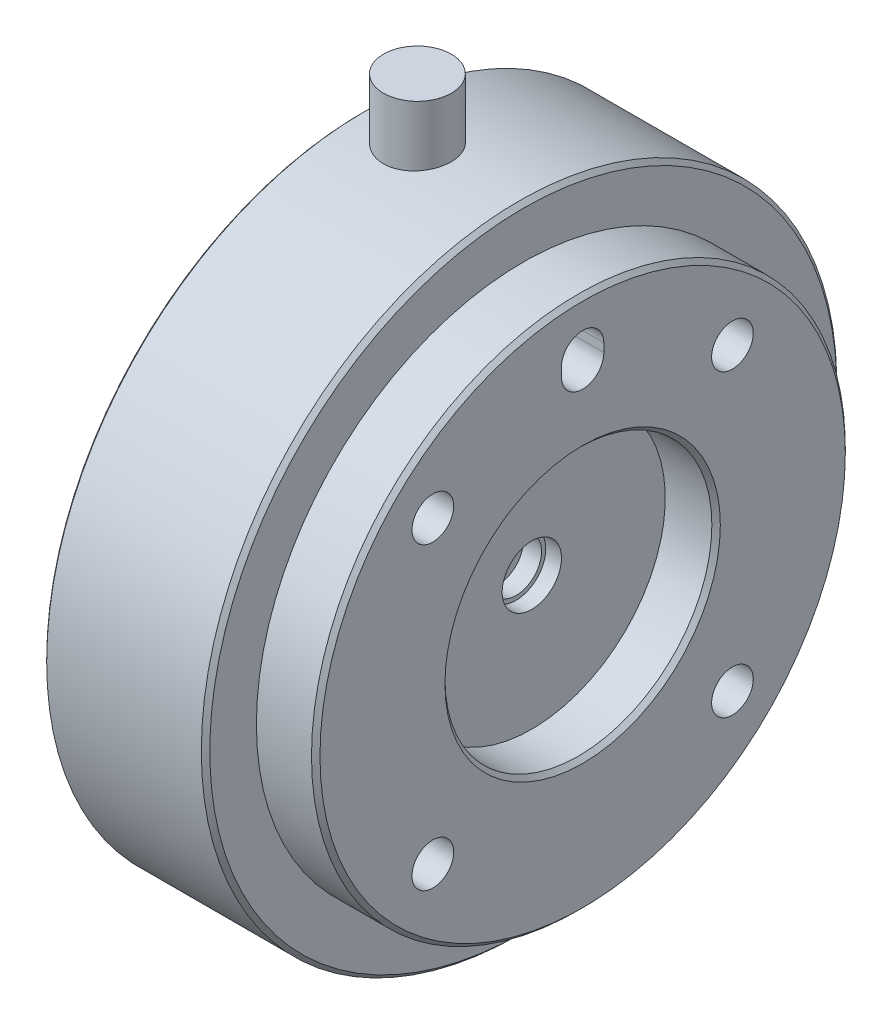
ISO-10303-21;
HEADER;
FILE_DESCRIPTION(('STEP AP214'),'2;1');
FILE_NAME('part.step','',(''),(''),'','','');
FILE_SCHEMA(('AUTOMOTIVE_DESIGN { 1 0 10303 214 1 1 1 1 }'));
ENDSEC;
DATA;
#1=APPLICATION_CONTEXT('core data for automotive mechanical design processes');
#2=APPLICATION_PROTOCOL_DEFINITION('international standard','automotive_design',2000,#1);
#3=PRODUCT_CONTEXT('',#1,'mechanical');
#4=PRODUCT('Part','Part','',(#3));
#5=PRODUCT_RELATED_PRODUCT_CATEGORY('part','',(#4));
#6=PRODUCT_DEFINITION_FORMATION('','',#4);
#7=PRODUCT_DEFINITION_CONTEXT('part definition',#1,'design');
#8=PRODUCT_DEFINITION('design','',#6,#7);
#9=PRODUCT_DEFINITION_SHAPE('','',#8);
#10=(LENGTH_UNIT() NAMED_UNIT(*) SI_UNIT(.MILLI.,.METRE.));
#11=(NAMED_UNIT(*) PLANE_ANGLE_UNIT() SI_UNIT($,.RADIAN.));
#12=(NAMED_UNIT(*) SI_UNIT($,.STERADIAN.) SOLID_ANGLE_UNIT());
#13=UNCERTAINTY_MEASURE_WITH_UNIT(LENGTH_MEASURE(1.E-05),#10,'distance_accuracy_value','');
#14=(GEOMETRIC_REPRESENTATION_CONTEXT(3) GLOBAL_UNCERTAINTY_ASSIGNED_CONTEXT((#13)) GLOBAL_UNIT_ASSIGNED_CONTEXT((#10,
#11,#12)) REPRESENTATION_CONTEXT('',''));
#15=CARTESIAN_POINT('',(0.,0.,0.));
#16=DIRECTION('',(0.,0.,1.));
#17=DIRECTION('',(1.,0.,0.));
#18=AXIS2_PLACEMENT_3D('',#15,#16,#17);
#19=CARTESIAN_POINT('',(24.5,0.,0.));
#20=DIRECTION('',(1.,0.,0.));
#21=DIRECTION('',(0.,0.,-1.));
#22=AXIS2_PLACEMENT_3D('',#19,#20,#21);
#23=PLANE('',#22);
#24=CARTESIAN_POINT('',(24.5,0.,0.));
#25=DIRECTION('',(1.,0.,0.));
#26=DIRECTION('',(0.,0.,-1.));
#27=AXIS2_PLACEMENT_3D('',#24,#25,#26);
#28=CIRCLE('',#27,3.);
#29=CARTESIAN_POINT('',(24.5,0.,-3.));
#30=VERTEX_POINT('',#29);
#31=EDGE_CURVE('P0_E19',#30,#30,#28,.T.);
#32=ORIENTED_EDGE('',*,*,#31,.T.);
#33=EDGE_LOOP('',(#32));
#34=FACE_BOUND('',#33,.T.);
#35=ADVANCED_FACE('P0_F16',(#34),#23,.T.);
#36=CARTESIAN_POINT('',(0.,0.,0.));
#37=DIRECTION('',(1.,0.,0.));
#38=DIRECTION('',(0.,0.,-1.));
#39=AXIS2_PLACEMENT_3D('',#36,#37,#38);
#40=CYLINDRICAL_SURFACE('',#39,3.);
#41=ORIENTED_EDGE('',*,*,#31,.F.);
#42=EDGE_LOOP('',(#41));
#43=FACE_BOUND('',#42,.T.);
#44=CARTESIAN_POINT('',(26.65,0.,0.));
#45=DIRECTION('',(1.,0.,0.));
#46=DIRECTION('',(0.,0.,-1.));
#47=AXIS2_PLACEMENT_3D('',#44,#45,#46);
#48=CIRCLE('',#47,3.);
#49=CARTESIAN_POINT('',(26.65,0.,-3.));
#50=VERTEX_POINT('',#49);
#51=EDGE_CURVE('P0_E93',#50,#50,#48,.F.);
#52=ORIENTED_EDGE('',*,*,#51,.F.);
#53=EDGE_LOOP('',(#52));
#54=FACE_BOUND('',#53,.T.);
#55=ADVANCED_FACE('P0_F101',(#43,#54),#40,.F.);
#56=CARTESIAN_POINT('',(26.65,0.,0.));
#57=DIRECTION('',(1.,0.,0.));
#58=DIRECTION('',(0.,0.,-1.));
#59=AXIS2_PLACEMENT_3D('',#56,#57,#58);
#60=PLANE('',#59);
#61=ORIENTED_EDGE('',*,*,#51,.T.);
#62=EDGE_LOOP('',(#61));
#63=FACE_BOUND('',#62,.T.);
#64=CARTESIAN_POINT('',(26.65,0.,0.));
#65=DIRECTION('',(1.,0.,0.));
#66=DIRECTION('',(0.,0.,-1.));
#67=AXIS2_PLACEMENT_3D('',#64,#65,#66);
#68=CIRCLE('',#67,3.5);
#69=CARTESIAN_POINT('',(26.65,0.,-3.5));
#70=VERTEX_POINT('',#69);
#71=EDGE_CURVE('P0_E91',#70,#70,#68,.T.);
#72=ORIENTED_EDGE('',*,*,#71,.T.);
#73=EDGE_LOOP('',(#72));
#74=FACE_BOUND('',#73,.T.);
#75=ADVANCED_FACE('P0_F104',(#63,#74),#60,.T.);
#76=CARTESIAN_POINT('',(26.65,0.,0.));
#77=DIRECTION('',(1.,0.,0.));
#78=DIRECTION('',(0.,0.,-1.));
#79=AXIS2_PLACEMENT_3D('',#76,#77,#78);
#80=CYLINDRICAL_SURFACE('',#79,3.5);
#81=ORIENTED_EDGE('',*,*,#71,.F.);
#82=EDGE_LOOP('',(#81));
#83=FACE_BOUND('',#82,.T.);
#84=CARTESIAN_POINT('',(28.5,0.,0.));
#85=DIRECTION('',(1.,0.,0.));
#86=DIRECTION('',(0.,0.,-1.));
#87=AXIS2_PLACEMENT_3D('',#84,#85,#86);
#88=CIRCLE('',#87,3.5);
#89=CARTESIAN_POINT('',(28.5,0.,-3.5));
#90=VERTEX_POINT('',#89);
#91=EDGE_CURVE('P0_E88',#90,#90,#88,.T.);
#92=ORIENTED_EDGE('',*,*,#91,.T.);
#93=EDGE_LOOP('',(#92));
#94=FACE_BOUND('',#93,.T.);
#95=ADVANCED_FACE('P0_F110',(#83,#94),#80,.F.);
#96=CARTESIAN_POINT('',(28.5,15.75,0.));
#97=DIRECTION('',(-1.,0.,0.));
#98=DIRECTION('',(0.,0.,1.));
#99=AXIS2_PLACEMENT_3D('',#96,#97,#98);
#100=PLANE('',#99);
#101=CARTESIAN_POINT('',(28.5,0.,0.));
#102=DIRECTION('',(-1.,0.,0.));
#103=DIRECTION('',(0.,0.,1.));
#104=AXIS2_PLACEMENT_3D('',#101,#102,#103);
#105=CIRCLE('',#104,15.75);
#106=CARTESIAN_POINT('',(28.5,0.,15.75));
#107=VERTEX_POINT('',#106);
#108=EDGE_CURVE('P0_E80',#107,#107,#105,.F.);
#109=ORIENTED_EDGE('',*,*,#108,.T.);
#110=EDGE_LOOP('',(#109));
#111=FACE_BOUND('',#110,.T.);
#112=ORIENTED_EDGE('',*,*,#91,.F.);
#113=EDGE_LOOP('',(#112));
#114=FACE_BOUND('',#113,.T.);
#115=ADVANCED_FACE('P0_F220',(#111,#114),#100,.F.);
#116=CARTESIAN_POINT('',(29.5,25.5,-2.49999999999999));
#117=DIRECTION('',(0.,0.,-1.));
#118=DIRECTION('',(-1.,0.,0.));
#119=AXIS2_PLACEMENT_3D('',#116,#117,#118);
#120=PLANE('',#119);
#121=DIRECTION('',(1.,0.,0.));
#122=VECTOR('',#121,1.);
#123=CARTESIAN_POINT('',(29.5,25.5,-2.49999999999999));
#124=LINE('',#123,#122);
#125=CARTESIAN_POINT('',(34.5,25.5,-2.49999999999999));
#126=VERTEX_POINT('',#125);
#127=CARTESIAN_POINT('',(29.5,25.5,-2.49999999999999));
#128=VERTEX_POINT('',#127);
#129=EDGE_CURVE('P0_E66',#126,#128,#124,.F.);
#130=ORIENTED_EDGE('',*,*,#129,.T.);
#131=DIRECTION('',(0.,1.,0.));
#132=VECTOR('',#131,1.);
#133=CARTESIAN_POINT('',(29.5,25.5,-2.49999999999999));
#134=LINE('',#133,#132);
#135=CARTESIAN_POINT('',(29.5,24.5,-2.49999999999999));
#136=VERTEX_POINT('',#135);
#137=EDGE_CURVE('P0_E60',#136,#128,#134,.T.);
#138=ORIENTED_EDGE('',*,*,#137,.F.);
#139=DIRECTION('',(1.,0.,0.));
#140=VECTOR('',#139,1.);
#141=CARTESIAN_POINT('',(29.5,24.5,-2.49999999999999));
#142=LINE('',#141,#140);
#143=CARTESIAN_POINT('',(34.5,24.5,-2.49999999999999));
#144=VERTEX_POINT('',#143);
#145=EDGE_CURVE('P0_E63',#136,#144,#142,.T.);
#146=ORIENTED_EDGE('',*,*,#145,.T.);
#147=DIRECTION('',(0.,1.,0.));
#148=VECTOR('',#147,1.);
#149=CARTESIAN_POINT('',(34.5,25.5,-2.49999999999999));
#150=LINE('',#149,#148);
#151=EDGE_CURVE('P0_E68',#126,#144,#150,.F.);
#152=ORIENTED_EDGE('',*,*,#151,.F.);
#153=EDGE_LOOP('',(#130,#138,#146,#152));
#154=FACE_BOUND('',#153,.T.);
#155=ADVANCED_FACE('P0_F62',(#154),#120,.F.);
#156=CARTESIAN_POINT('',(29.5,25.5,0.));
#157=DIRECTION('',(1.,0.,0.));
#158=DIRECTION('',(0.,0.,-1.));
#159=AXIS2_PLACEMENT_3D('',#156,#157,#158);
#160=PLANE('',#159);
#161=CARTESIAN_POINT('',(29.5,24.5,0.));
#162=DIRECTION('',(1.,0.,0.));
#163=DIRECTION('',(0.,0.,-1.));
#164=AXIS2_PLACEMENT_3D('',#161,#162,#163);
#165=CIRCLE('',#164,2.5);
#166=CARTESIAN_POINT('',(29.5,24.5,2.50000000000001));
#167=VERTEX_POINT('',#166);
#168=EDGE_CURVE('P0_E73',#167,#136,#165,.T.);
#169=ORIENTED_EDGE('',*,*,#168,.T.);
#170=ORIENTED_EDGE('',*,*,#137,.T.);
#171=CARTESIAN_POINT('',(29.5,25.5,0.));
#172=DIRECTION('',(1.,0.,0.));
#173=DIRECTION('',(0.,0.,-1.));
#174=AXIS2_PLACEMENT_3D('',#171,#172,#173);
#175=CIRCLE('',#174,2.5);
#176=CARTESIAN_POINT('',(29.5,25.5,2.50000000000001));
#177=VERTEX_POINT('',#176);
#178=EDGE_CURVE('P0_E84',#128,#177,#175,.T.);
#179=ORIENTED_EDGE('',*,*,#178,.T.);
#180=DIRECTION('',(0.,1.,0.));
#181=VECTOR('',#180,1.);
#182=CARTESIAN_POINT('',(29.5,24.5,2.50000000000001));
#183=LINE('',#182,#181);
#184=EDGE_CURVE('P0_E54',#177,#167,#183,.F.);
#185=ORIENTED_EDGE('',*,*,#184,.T.);
#186=EDGE_LOOP('',(#169,#170,#179,#185));
#187=FACE_BOUND('',#186,.T.);
#188=ADVANCED_FACE('P0_F77',(#187),#160,.T.);
#189=CARTESIAN_POINT('',(29.5,24.5,2.50000000000001));
#190=DIRECTION('',(0.,0.,1.));
#191=DIRECTION('',(1.,0.,0.));
#192=AXIS2_PLACEMENT_3D('',#189,#190,#191);
#193=PLANE('',#192);
#194=DIRECTION('',(1.,0.,0.));
#195=VECTOR('',#194,1.);
#196=CARTESIAN_POINT('',(29.5,24.5,2.50000000000001));
#197=LINE('',#196,#195);
#198=CARTESIAN_POINT('',(34.5,24.5,2.50000000000001));
#199=VERTEX_POINT('',#198);
#200=EDGE_CURVE('P0_E78',#199,#167,#197,.F.);
#201=ORIENTED_EDGE('',*,*,#200,.T.);
#202=ORIENTED_EDGE('',*,*,#184,.F.);
#203=DIRECTION('',(1.,0.,0.));
#204=VECTOR('',#203,1.);
#205=CARTESIAN_POINT('',(29.5,25.5,2.50000000000001));
#206=LINE('',#205,#204);
#207=CARTESIAN_POINT('',(34.5,25.5,2.50000000000001));
#208=VERTEX_POINT('',#207);
#209=EDGE_CURVE('P0_E430',#177,#208,#206,.T.);
#210=ORIENTED_EDGE('',*,*,#209,.T.);
#211=DIRECTION('',(0.,1.,0.));
#212=VECTOR('',#211,1.);
#213=CARTESIAN_POINT('',(34.5,24.5,2.50000000000001));
#214=LINE('',#213,#212);
#215=EDGE_CURVE('P0_E34',#199,#208,#214,.T.);
#216=ORIENTED_EDGE('',*,*,#215,.F.);
#217=EDGE_LOOP('',(#201,#202,#210,#216));
#218=FACE_BOUND('',#217,.T.);
#219=ADVANCED_FACE('P0_F211',(#218),#193,.F.);
#220=CARTESIAN_POINT('',(0.,0.,0.));
#221=DIRECTION('',(-1.,0.,0.));
#222=DIRECTION('',(0.,0.,1.));
#223=AXIS2_PLACEMENT_3D('',#220,#221,#222);
#224=CYLINDRICAL_SURFACE('',#223,15.75);
#225=ORIENTED_EDGE('',*,*,#108,.F.);
#226=EDGE_LOOP('',(#225));
#227=FACE_BOUND('',#226,.T.);
#228=CARTESIAN_POINT('',(34.,0.,0.));
#229=DIRECTION('',(1.,0.,0.));
#230=DIRECTION('',(0.,0.,-1.));
#231=AXIS2_PLACEMENT_3D('',#228,#229,#230);
#232=CIRCLE('',#231,15.75);
#233=CARTESIAN_POINT('',(34.,0.,-15.75));
#234=VERTEX_POINT('',#233);
#235=EDGE_CURVE('P0_E432',#234,#234,#232,.T.);
#236=ORIENTED_EDGE('',*,*,#235,.T.);
#237=EDGE_LOOP('',(#236));
#238=FACE_BOUND('',#237,.T.);
#239=ADVANCED_FACE('P0_F207',(#227,#238),#224,.F.);
#240=CARTESIAN_POINT('',(29.,-17.6776695296635,-17.6776695296638));
#241=DIRECTION('',(1.,0.,0.));
#242=DIRECTION('',(0.,0.,-1.));
#243=AXIS2_PLACEMENT_3D('',#240,#241,#242);
#244=PLANE('',#243);
#245=CARTESIAN_POINT('',(28.9999999999964,-17.6776695296635,-17.6776695296638));
#246=DIRECTION('',(1.,0.,0.));
#247=DIRECTION('',(0.,0.,-1.));
#248=AXIS2_PLACEMENT_3D('',#245,#246,#247);
#249=CIRCLE('',#248,2.46);
#250=CARTESIAN_POINT('',(28.9999999999964,-17.6776695296635,-20.1376695296638));
#251=VERTEX_POINT('',#250);
#252=EDGE_CURVE('P0_E436',#251,#251,#249,.T.);
#253=ORIENTED_EDGE('',*,*,#252,.T.);
#254=EDGE_LOOP('',(#253));
#255=FACE_BOUND('',#254,.T.);
#256=ADVANCED_FACE('P0_F203',(#255),#244,.T.);
#257=CARTESIAN_POINT('',(29.,17.6776695296637,-17.6776695296637));
#258=DIRECTION('',(1.,0.,0.));
#259=DIRECTION('',(0.,0.,-1.));
#260=AXIS2_PLACEMENT_3D('',#257,#258,#259);
#261=PLANE('',#260);
#262=CARTESIAN_POINT('',(28.9999999999964,17.6776695296637,-17.6776695296637));
#263=DIRECTION('',(1.,0.,0.));
#264=DIRECTION('',(0.,0.,-1.));
#265=AXIS2_PLACEMENT_3D('',#262,#263,#264);
#266=CIRCLE('',#265,2.46);
#267=CARTESIAN_POINT('',(28.9999999999964,17.6776695296637,-20.1376695296637));
#268=VERTEX_POINT('',#267);
#269=EDGE_CURVE('P0_E455',#268,#268,#266,.T.);
#270=ORIENTED_EDGE('',*,*,#269,.T.);
#271=EDGE_LOOP('',(#270));
#272=FACE_BOUND('',#271,.T.);
#273=ADVANCED_FACE('P0_F199',(#272),#261,.T.);
#274=CARTESIAN_POINT('',(29.,17.6776695296637,17.6776695296637));
#275=DIRECTION('',(1.,0.,0.));
#276=DIRECTION('',(0.,0.,-1.));
#277=AXIS2_PLACEMENT_3D('',#274,#275,#276);
#278=PLANE('',#277);
#279=CARTESIAN_POINT('',(28.9999999999964,17.6776695296637,17.6776695296637));
#280=DIRECTION('',(1.,0.,0.));
#281=DIRECTION('',(0.,0.,-1.));
#282=AXIS2_PLACEMENT_3D('',#279,#280,#281);
#283=CIRCLE('',#282,2.46);
#284=CARTESIAN_POINT('',(28.9999999999964,17.6776695296637,15.2176695296637));
#285=VERTEX_POINT('',#284);
#286=EDGE_CURVE('P0_E452',#285,#285,#283,.T.);
#287=ORIENTED_EDGE('',*,*,#286,.T.);
#288=EDGE_LOOP('',(#287));
#289=FACE_BOUND('',#288,.T.);
#290=ADVANCED_FACE('P0_F195',(#289),#278,.T.);
#291=CARTESIAN_POINT('',(29.,-17.6776695296638,17.6776695296636));
#292=DIRECTION('',(1.,0.,0.));
#293=DIRECTION('',(0.,0.,-1.));
#294=AXIS2_PLACEMENT_3D('',#291,#292,#293);
#295=PLANE('',#294);
#296=CARTESIAN_POINT('',(28.9999999999964,-17.6776695296638,17.6776695296636));
#297=DIRECTION('',(1.,0.,0.));
#298=DIRECTION('',(0.,0.,-1.));
#299=AXIS2_PLACEMENT_3D('',#296,#297,#298);
#300=CIRCLE('',#299,2.46);
#301=CARTESIAN_POINT('',(28.9999999999964,-17.6776695296638,15.2176695296636));
#302=VERTEX_POINT('',#301);
#303=EDGE_CURVE('P0_E446',#302,#302,#300,.T.);
#304=ORIENTED_EDGE('',*,*,#303,.T.);
#305=EDGE_LOOP('',(#304));
#306=FACE_BOUND('',#305,.T.);
#307=ADVANCED_FACE('P0_F192',(#306),#295,.T.);
#308=CARTESIAN_POINT('',(29.5,24.5,0.));
#309=DIRECTION('',(1.,0.,0.));
#310=DIRECTION('',(0.,0.,-1.));
#311=AXIS2_PLACEMENT_3D('',#308,#309,#310);
#312=CYLINDRICAL_SURFACE('',#311,2.5);
#313=ORIENTED_EDGE('',*,*,#145,.F.);
#314=ORIENTED_EDGE('',*,*,#168,.F.);
#315=ORIENTED_EDGE('',*,*,#200,.F.);
#316=CARTESIAN_POINT('',(34.5,24.5,0.));
#317=DIRECTION('',(1.,0.,0.));
#318=DIRECTION('',(0.,0.,-1.));
#319=AXIS2_PLACEMENT_3D('',#316,#317,#318);
#320=CIRCLE('',#319,2.5);
#321=EDGE_CURVE('P0_E75',#199,#144,#320,.T.);
#322=ORIENTED_EDGE('',*,*,#321,.T.);
#323=EDGE_LOOP('',(#313,#314,#315,#322));
#324=FACE_BOUND('',#323,.T.);
#325=ADVANCED_FACE('P0_F71',(#324),#312,.F.);
#326=CARTESIAN_POINT('',(29.5,25.5,0.));
#327=DIRECTION('',(1.,0.,0.));
#328=DIRECTION('',(0.,0.,-1.));
#329=AXIS2_PLACEMENT_3D('',#326,#327,#328);
#330=CYLINDRICAL_SURFACE('',#329,2.5);
#331=ORIENTED_EDGE('',*,*,#209,.F.);
#332=ORIENTED_EDGE('',*,*,#178,.F.);
#333=ORIENTED_EDGE('',*,*,#129,.F.);
#334=CARTESIAN_POINT('',(34.5,25.5,0.));
#335=DIRECTION('',(1.,0.,0.));
#336=DIRECTION('',(0.,0.,-1.));
#337=AXIS2_PLACEMENT_3D('',#334,#335,#336);
#338=CIRCLE('',#337,2.5);
#339=EDGE_CURVE('P0_E439',#126,#208,#338,.T.);
#340=ORIENTED_EDGE('',*,*,#339,.T.);
#341=EDGE_LOOP('',(#331,#332,#333,#340));
#342=FACE_BOUND('',#341,.T.);
#343=ADVANCED_FACE('P0_F185',(#342),#330,.F.);
#344=CARTESIAN_POINT('',(34.5,0.,0.));
#345=DIRECTION('',(1.,0.,0.));
#346=DIRECTION('',(0.,0.,-1.));
#347=AXIS2_PLACEMENT_3D('',#344,#345,#346);
#348=CONICAL_SURFACE('',#347,16.25,0.785398163397438);
#349=CARTESIAN_POINT('',(34.5,0.,0.));
#350=DIRECTION('',(1.,0.,0.));
#351=DIRECTION('',(0.,0.,-1.));
#352=AXIS2_PLACEMENT_3D('',#349,#350,#351);
#353=CIRCLE('',#352,16.25);
#354=CARTESIAN_POINT('',(34.5,0.,-16.25));
#355=VERTEX_POINT('',#354);
#356=EDGE_CURVE('P0_E441',#355,#355,#353,.T.);
#357=ORIENTED_EDGE('',*,*,#356,.T.);
#358=EDGE_LOOP('',(#357));
#359=FACE_BOUND('',#358,.T.);
#360=ORIENTED_EDGE('',*,*,#235,.F.);
#361=EDGE_LOOP('',(#360));
#362=FACE_BOUND('',#361,.T.);
#363=ADVANCED_FACE('P0_F181',(#359,#362),#348,.F.);
#364=CARTESIAN_POINT('',(-500000.,-17.6776695296635,-17.6776695296638));
#365=DIRECTION('',(1.,0.,0.));
#366=DIRECTION('',(0.,0.,-1.));
#367=AXIS2_PLACEMENT_3D('',#364,#365,#366);
#368=CYLINDRICAL_SURFACE('',#367,2.46);
#369=ORIENTED_EDGE('',*,*,#252,.F.);
#370=EDGE_LOOP('',(#369));
#371=FACE_BOUND('',#370,.T.);
#372=CARTESIAN_POINT('',(34.49999999998,-17.6776695296635,-17.6776695296638));
#373=DIRECTION('',(1.,0.,0.));
#374=DIRECTION('',(0.,0.,-1.));
#375=AXIS2_PLACEMENT_3D('',#372,#373,#374);
#376=CIRCLE('',#375,2.46);
#377=CARTESIAN_POINT('',(34.49999999998,-17.6776695296635,-20.1376695296638));
#378=VERTEX_POINT('',#377);
#379=EDGE_CURVE('P0_E444',#378,#378,#376,.T.);
#380=ORIENTED_EDGE('',*,*,#379,.T.);
#381=EDGE_LOOP('',(#380));
#382=FACE_BOUND('',#381,.T.);
#383=ADVANCED_FACE('P0_F177',(#371,#382),#368,.F.);
#384=CARTESIAN_POINT('',(-500000.,17.6776695296637,-17.6776695296637));
#385=DIRECTION('',(1.,0.,0.));
#386=DIRECTION('',(0.,0.,-1.));
#387=AXIS2_PLACEMENT_3D('',#384,#385,#386);
#388=CYLINDRICAL_SURFACE('',#387,2.46);
#389=ORIENTED_EDGE('',*,*,#269,.F.);
#390=EDGE_LOOP('',(#389));
#391=FACE_BOUND('',#390,.T.);
#392=CARTESIAN_POINT('',(34.49999999998,17.6776695296637,-17.6776695296637));
#393=DIRECTION('',(1.,0.,0.));
#394=DIRECTION('',(0.,0.,-1.));
#395=AXIS2_PLACEMENT_3D('',#392,#393,#394);
#396=CIRCLE('',#395,2.46);
#397=CARTESIAN_POINT('',(34.49999999998,17.6776695296637,-20.1376695296637));
#398=VERTEX_POINT('',#397);
#399=EDGE_CURVE('P0_E463',#398,#398,#396,.T.);
#400=ORIENTED_EDGE('',*,*,#399,.T.);
#401=EDGE_LOOP('',(#400));
#402=FACE_BOUND('',#401,.T.);
#403=ADVANCED_FACE('P0_F173',(#391,#402),#388,.F.);
#404=CARTESIAN_POINT('',(-500000.,17.6776695296637,17.6776695296637));
#405=DIRECTION('',(1.,0.,0.));
#406=DIRECTION('',(0.,0.,-1.));
#407=AXIS2_PLACEMENT_3D('',#404,#405,#406);
#408=CYLINDRICAL_SURFACE('',#407,2.46);
#409=ORIENTED_EDGE('',*,*,#286,.F.);
#410=EDGE_LOOP('',(#409));
#411=FACE_BOUND('',#410,.T.);
#412=CARTESIAN_POINT('',(34.49999999998,17.6776695296637,17.6776695296637));
#413=DIRECTION('',(1.,0.,0.));
#414=DIRECTION('',(0.,0.,-1.));
#415=AXIS2_PLACEMENT_3D('',#412,#413,#414);
#416=CIRCLE('',#415,2.46);
#417=CARTESIAN_POINT('',(34.49999999998,17.6776695296637,15.2176695296637));
#418=VERTEX_POINT('',#417);
#419=EDGE_CURVE('P0_E465',#418,#418,#416,.T.);
#420=ORIENTED_EDGE('',*,*,#419,.T.);
#421=EDGE_LOOP('',(#420));
#422=FACE_BOUND('',#421,.T.);
#423=ADVANCED_FACE('P0_F169',(#411,#422),#408,.F.);
#424=CARTESIAN_POINT('',(-500000.,-17.6776695296638,17.6776695296636));
#425=DIRECTION('',(1.,0.,0.));
#426=DIRECTION('',(0.,0.,-1.));
#427=AXIS2_PLACEMENT_3D('',#424,#425,#426);
#428=CYLINDRICAL_SURFACE('',#427,2.46);
#429=ORIENTED_EDGE('',*,*,#303,.F.);
#430=EDGE_LOOP('',(#429));
#431=FACE_BOUND('',#430,.T.);
#432=CARTESIAN_POINT('',(34.49999999998,-17.6776695296638,17.6776695296636));
#433=DIRECTION('',(1.,0.,0.));
#434=DIRECTION('',(0.,0.,-1.));
#435=AXIS2_PLACEMENT_3D('',#432,#433,#434);
#436=CIRCLE('',#435,2.46);
#437=CARTESIAN_POINT('',(34.49999999998,-17.6776695296638,15.2176695296636));
#438=VERTEX_POINT('',#437);
#439=EDGE_CURVE('P0_E470',#438,#438,#436,.T.);
#440=ORIENTED_EDGE('',*,*,#439,.T.);
#441=EDGE_LOOP('',(#440));
#442=FACE_BOUND('',#441,.T.);
#443=ADVANCED_FACE('P0_F165',(#431,#442),#428,.F.);
#444=CARTESIAN_POINT('',(34.5,31.5,0.));
#445=DIRECTION('',(-1.,0.,0.));
#446=DIRECTION('',(0.,0.,1.));
#447=AXIS2_PLACEMENT_3D('',#444,#445,#446);
#448=PLANE('',#447);
#449=ORIENTED_EDGE('',*,*,#439,.F.);
#450=EDGE_LOOP('',(#449));
#451=FACE_BOUND('',#450,.T.);
#452=ORIENTED_EDGE('',*,*,#419,.F.);
#453=EDGE_LOOP('',(#452));
#454=FACE_BOUND('',#453,.T.);
#455=ORIENTED_EDGE('',*,*,#399,.F.);
#456=EDGE_LOOP('',(#455));
#457=FACE_BOUND('',#456,.T.);
#458=ORIENTED_EDGE('',*,*,#379,.F.);
#459=EDGE_LOOP('',(#458));
#460=FACE_BOUND('',#459,.T.);
#461=CARTESIAN_POINT('',(34.5,0.,0.));
#462=DIRECTION('',(-1.,0.,0.));
#463=DIRECTION('',(0.,0.,1.));
#464=AXIS2_PLACEMENT_3D('',#461,#462,#463);
#465=CIRCLE('',#464,31.);
#466=CARTESIAN_POINT('',(34.5,0.,31.));
#467=VERTEX_POINT('',#466);
#468=EDGE_CURVE('P0_E429',#467,#467,#465,.T.);
#469=ORIENTED_EDGE('',*,*,#468,.F.);
#470=EDGE_LOOP('',(#469));
#471=FACE_BOUND('',#470,.T.);
#472=ORIENTED_EDGE('',*,*,#356,.F.);
#473=EDGE_LOOP('',(#472));
#474=FACE_BOUND('',#473,.T.);
#475=ORIENTED_EDGE('',*,*,#339,.F.);
#476=ORIENTED_EDGE('',*,*,#151,.T.);
#477=ORIENTED_EDGE('',*,*,#321,.F.);
#478=ORIENTED_EDGE('',*,*,#215,.T.);
#479=EDGE_LOOP('',(#475,#476,#477,#478));
#480=FACE_BOUND('',#479,.T.);
#481=ADVANCED_FACE('P0_F161',(#451,#454,#457,#460,#471,#474,#480),#448,.F.);
#482=CARTESIAN_POINT('',(34.,0.,0.));
#483=DIRECTION('',(-1.,0.,0.));
#484=DIRECTION('',(0.,0.,1.));
#485=AXIS2_PLACEMENT_3D('',#482,#483,#484);
#486=CONICAL_SURFACE('',#485,31.5,0.785398163397448);
#487=CARTESIAN_POINT('',(34.,0.,0.));
#488=DIRECTION('',(-1.,0.,0.));
#489=DIRECTION('',(0.,0.,1.));
#490=AXIS2_PLACEMENT_3D('',#487,#488,#489);
#491=CIRCLE('',#490,31.5);
#492=CARTESIAN_POINT('',(34.,0.,31.5));
#493=VERTEX_POINT('',#492);
#494=EDGE_CURVE('P0_E425',#493,#493,#491,.T.);
#495=ORIENTED_EDGE('',*,*,#494,.F.);
#496=EDGE_LOOP('',(#495));
#497=FACE_BOUND('',#496,.T.);
#498=ORIENTED_EDGE('',*,*,#468,.T.);
#499=EDGE_LOOP('',(#498));
#500=FACE_BOUND('',#499,.T.);
#501=ADVANCED_FACE('P0_F157',(#497,#500),#486,.T.);
#502=CARTESIAN_POINT('',(0.,0.,0.));
#503=DIRECTION('',(-1.,0.,0.));
#504=DIRECTION('',(0.,0.,1.));
#505=AXIS2_PLACEMENT_3D('',#502,#503,#504);
#506=CYLINDRICAL_SURFACE('',#505,31.5);
#507=CARTESIAN_POINT('',(27.5,0.,0.));
#508=DIRECTION('',(-1.,0.,0.));
#509=DIRECTION('',(0.,0.,1.));
#510=AXIS2_PLACEMENT_3D('',#507,#508,#509);
#511=CIRCLE('',#510,31.5);
#512=CARTESIAN_POINT('',(27.5,0.,31.5));
#513=VERTEX_POINT('',#512);
#514=EDGE_CURVE('P0_E428',#513,#513,#511,.F.);
#515=ORIENTED_EDGE('',*,*,#514,.T.);
#516=EDGE_LOOP('',(#515));
#517=FACE_BOUND('',#516,.T.);
#518=ORIENTED_EDGE('',*,*,#494,.T.);
#519=EDGE_LOOP('',(#518));
#520=FACE_BOUND('',#519,.T.);
#521=ADVANCED_FACE('P0_F153',(#517,#520),#506,.T.);
#522=CARTESIAN_POINT('',(15.,36.,0.));
#523=DIRECTION('',(0.,-1.,0.));
#524=DIRECTION('',(1.,0.,0.));
#525=AXIS2_PLACEMENT_3D('',#522,#523,#524);
#526=PLANE('',#525);
#527=CARTESIAN_POINT('',(15.,36.,0.));
#528=DIRECTION('',(0.,1.,0.));
#529=DIRECTION('',(-1.,0.,0.));
#530=AXIS2_PLACEMENT_3D('',#527,#528,#529);
#531=CIRCLE('',#530,3.99999999999993);
#532=CARTESIAN_POINT('',(11.,36.,0.));
#533=VERTEX_POINT('',#532);
#534=EDGE_CURVE('P0_E476',#533,#533,#531,.T.);
#535=ORIENTED_EDGE('',*,*,#534,.T.);
#536=EDGE_LOOP('',(#535));
#537=FACE_BOUND('',#536,.T.);
#538=ADVANCED_FACE('P0_F149',(#537),#526,.F.);
#539=CARTESIAN_POINT('',(27.5,37.5,0.));
#540=DIRECTION('',(-1.,0.,0.));
#541=DIRECTION('',(0.,0.,1.));
#542=AXIS2_PLACEMENT_3D('',#539,#540,#541);
#543=PLANE('',#542);
#544=ORIENTED_EDGE('',*,*,#514,.F.);
#545=EDGE_LOOP('',(#544));
#546=FACE_BOUND('',#545,.T.);
#547=CARTESIAN_POINT('',(27.5,0.,0.));
#548=DIRECTION('',(-1.,0.,0.));
#549=DIRECTION('',(0.,-1.,0.));
#550=AXIS2_PLACEMENT_3D('',#547,#548,#549);
#551=CIRCLE('',#550,37.);
#552=CARTESIAN_POINT('',(27.5,-37.,0.));
#553=VERTEX_POINT('',#552);
#554=EDGE_CURVE('P0_E138',#553,#553,#551,.T.);
#555=ORIENTED_EDGE('',*,*,#554,.F.);
#556=EDGE_LOOP('',(#555));
#557=FACE_BOUND('',#556,.T.);
#558=ADVANCED_FACE('P0_F145',(#546,#557),#543,.F.);
#559=CARTESIAN_POINT('',(15.,36.9628931514841,0.));
#560=DIRECTION('',(0.,1.,0.));
#561=DIRECTION('',(-1.,0.,0.));
#562=AXIS2_PLACEMENT_3D('',#559,#560,#561);
#563=CYLINDRICAL_SURFACE('',#562,3.99999999999993);
#564=ORIENTED_EDGE('',*,*,#534,.F.);
#565=EDGE_LOOP('',(#564));
#566=FACE_BOUND('',#565,.T.);
#567=CARTESIAN_POINT('',(18.9999999999999,37.5,0.));
#568=CARTESIAN_POINT('',(18.9999993366907,37.4999998229217,0.111948208586025));
#569=CARTESIAN_POINT('',(18.9952960941309,37.4994973370183,0.223915142484988));
#570=CARTESIAN_POINT('',(18.9765134821787,37.4975009224054,0.447093119129846));
#571=CARTESIAN_POINT('',(18.9624295988427,37.4960065163872,0.558303771915953));
#572=CARTESIAN_POINT('',(18.9249488523558,37.4920641271484,0.77932890387847));
#573=CARTESIAN_POINT('',(18.9015364906387,37.4896145571399,0.889140744118599));
#574=CARTESIAN_POINT('',(18.8455800376359,37.4838328393394,1.10640066472981));
#575=CARTESIAN_POINT('',(18.8130324990919,37.4805003583981,1.21384783622883));
#576=CARTESIAN_POINT('',(18.7020969490021,37.4693210548366,1.5311864631686));
#577=CARTESIAN_POINT('',(18.6103363185214,37.4602834659545,1.73654183696981));
#578=CARTESIAN_POINT('',(18.3939224003271,37.4400479093461,2.12873431634259));
#579=CARTESIAN_POINT('',(18.2692832984947,37.4288508739025,2.31557936074639));
#580=CARTESIAN_POINT('',(17.9900451181548,37.4054941311422,2.66646923589602));
#581=CARTESIAN_POINT('',(17.8353364240108,37.3933310009873,2.83042675641855));
#582=CARTESIAN_POINT('',(17.5005882513845,37.3694410999601,3.13010240308989));
#583=CARTESIAN_POINT('',(17.3205463333755,37.3577143712499,3.26581780646907));
#584=CARTESIAN_POINT('',(16.9397106654717,37.3359921224474,3.50546054875743));
#585=CARTESIAN_POINT('',(16.7388680757547,37.3260008313155,3.6093106963815));
#586=CARTESIAN_POINT('',(16.322472560095,37.308922673319,3.78177809428265));
#587=CARTESIAN_POINT('',(16.1069201735063,37.3018357000304,3.85039663558744));
#588=CARTESIAN_POINT('',(15.6680946293657,37.2913990913524,3.95020098215998));
#589=CARTESIAN_POINT('',(15.444854092125,37.2880352900068,3.98152870643213));
#590=CARTESIAN_POINT('',(14.9962599841981,37.2853821034346,4.00630068407313));
#591=CARTESIAN_POINT('',(14.7709064726912,37.2860926044346,3.99974599529474));
#592=CARTESIAN_POINT('',(14.3254668583952,37.2914947826221,3.94905641015973));
#593=CARTESIAN_POINT('',(14.1053628164999,37.2961699720051,3.90507714739592));
#594=CARTESIAN_POINT('',(13.6756754212265,37.3089490974144,3.78102776326113));
#595=CARTESIAN_POINT('',(13.4660923226522,37.3170531164378,3.70095676826317));
#596=CARTESIAN_POINT('',(13.0629028986764,37.3357959504025,3.50682555786602));
#597=CARTESIAN_POINT('',(12.8693304605108,37.3464399653612,3.39269549319024));
#598=CARTESIAN_POINT('',(12.5040417428836,37.3690583255101,3.13373655140211));
#599=CARTESIAN_POINT('',(12.3323243956319,37.381032605653,2.98890917501307));
#600=CARTESIAN_POINT('',(12.0147428886199,37.4050332567236,2.67186402077284));
#601=CARTESIAN_POINT('',(11.8690076190311,37.4170595998723,2.49951731338206));
#602=CARTESIAN_POINT('',(11.6084098677119,37.4397642879183,2.13253593520071));
#603=CARTESIAN_POINT('',(11.4935616483624,37.450442008874,1.93789102696152));
#604=CARTESIAN_POINT('',(11.3470231128211,37.4645419062408,1.6335618063449));
#605=CARTESIAN_POINT('',(11.3024324491932,37.4689260388978,1.52994241811621));
#606=CARTESIAN_POINT('',(11.2221513965957,37.4769333976658,1.31929490768505));
#607=CARTESIAN_POINT('',(11.1864576249376,37.4805569128882,1.2122680985266));
#608=CARTESIAN_POINT('',(11.1242871120551,37.4869336850006,0.995752170623464));
#609=CARTESIAN_POINT('',(11.0977948449808,37.4896884070898,0.886267534702629));
#610=CARTESIAN_POINT('',(11.0541424225761,37.4942571323083,0.665477082192479));
#611=CARTESIAN_POINT('',(11.0369777190217,37.4960715938989,0.554172180508247));
#612=CARTESIAN_POINT('',(11.0163643758391,37.4982571825854,0.368929399828513));
#613=CARTESIAN_POINT('',(11.0102298818743,37.4989099707961,0.295282743159753));
#614=CARTESIAN_POINT('',(11.002047474567,37.4997814379911,0.147760109822918));
#615=CARTESIAN_POINT('',(10.9999995622259,37.500000116869,0.0738841330986491));
#616=CARTESIAN_POINT('',(11.0000006633093,37.4999998229217,-0.111948208586023));
#617=CARTESIAN_POINT('',(11.0047039058691,37.4994973370183,-0.223915142484986));
#618=CARTESIAN_POINT('',(11.0234865178213,37.4975009224054,-0.447093119129844));
#619=CARTESIAN_POINT('',(11.0375704011573,37.4960065163872,-0.55830377191595));
#620=CARTESIAN_POINT('',(11.0750511476442,37.4920641271484,-0.779328903878467));
#621=CARTESIAN_POINT('',(11.0984635093613,37.4896145571399,-0.889140744118597));
#622=CARTESIAN_POINT('',(11.1544199623641,37.4838328393394,-1.1064006647298));
#623=CARTESIAN_POINT('',(11.1869675009081,37.4805003583981,-1.21384783622883));
#624=CARTESIAN_POINT('',(11.2979030509979,37.4693210548366,-1.5311864631686));
#625=CARTESIAN_POINT('',(11.3896636814786,37.4602834659545,-1.73654183696981));
#626=CARTESIAN_POINT('',(11.6060775996729,37.4400479093461,-2.12873431634259));
#627=CARTESIAN_POINT('',(11.7307167015053,37.4288508739025,-2.31557936074639));
#628=CARTESIAN_POINT('',(12.0099548818451,37.4054941311422,-2.66646923589601));
#629=CARTESIAN_POINT('',(12.1646635759891,37.3933310009873,-2.83042675641855));
#630=CARTESIAN_POINT('',(12.4994117486155,37.3694410999601,-3.13010240308989));
#631=CARTESIAN_POINT('',(12.6794536666245,37.3577143712499,-3.26581780646907));
#632=CARTESIAN_POINT('',(13.0602893345283,37.3359921224474,-3.50546054875743));
#633=CARTESIAN_POINT('',(13.2611319242453,37.3260008313155,-3.6093106963815));
#634=CARTESIAN_POINT('',(13.677527439905,37.308922673319,-3.78177809428265));
#635=CARTESIAN_POINT('',(13.8930798264937,37.3018357000304,-3.85039663558744));
#636=CARTESIAN_POINT('',(14.3319053706343,37.2913990913524,-3.95020098215998));
#637=CARTESIAN_POINT('',(14.5551459078749,37.2880352900068,-3.98152870643213));
#638=CARTESIAN_POINT('',(15.0037400158019,37.2853821034346,-4.00630068407313));
#639=CARTESIAN_POINT('',(15.2290935273087,37.2860926044346,-3.99974599529474));
#640=CARTESIAN_POINT('',(15.6745331416047,37.2914947826221,-3.94905641015973));
#641=CARTESIAN_POINT('',(15.8946371835001,37.2961699720051,-3.90507714739592));
#642=CARTESIAN_POINT('',(16.3243245787734,37.3089490974144,-3.78102776326113));
#643=CARTESIAN_POINT('',(16.5339076773478,37.3170531164378,-3.70095676826317));
#644=CARTESIAN_POINT('',(16.9370971013236,37.3357959504025,-3.50682555786602));
#645=CARTESIAN_POINT('',(17.1306695394892,37.3464399653612,-3.39269549319024));
#646=CARTESIAN_POINT('',(17.4959582571163,37.3690583255101,-3.13373655140211));
#647=CARTESIAN_POINT('',(17.6676756043681,37.381032605653,-2.98890917501307));
#648=CARTESIAN_POINT('',(17.9852571113801,37.4050332567236,-2.67186402077284));
#649=CARTESIAN_POINT('',(18.1309923809689,37.4170595998723,-2.49951731338206));
#650=CARTESIAN_POINT('',(18.3915901322881,37.4397642879183,-2.13253593520071));
#651=CARTESIAN_POINT('',(18.5064383516375,37.450442008874,-1.93789102696152));
#652=CARTESIAN_POINT('',(18.6529768871789,37.4645419062408,-1.6335618063449));
#653=CARTESIAN_POINT('',(18.6975675508067,37.4689260388978,-1.52994241811621));
#654=CARTESIAN_POINT('',(18.7778486034042,37.4769333976658,-1.31929490768505));
#655=CARTESIAN_POINT('',(18.8135423750624,37.4805569128882,-1.2122680985266));
#656=CARTESIAN_POINT('',(18.8757128879448,37.4869336850006,-0.995752170623466));
#657=CARTESIAN_POINT('',(18.9022051550192,37.4896884070898,-0.886267534702633));
#658=CARTESIAN_POINT('',(18.9458575774239,37.4942571323083,-0.665477082192482));
#659=CARTESIAN_POINT('',(18.9630222809782,37.4960715938989,-0.55417218050825));
#660=CARTESIAN_POINT('',(18.9836356241609,37.4982571825854,-0.368929399828514));
#661=CARTESIAN_POINT('',(18.9897701181256,37.4989099707961,-0.295282743159753));
#662=CARTESIAN_POINT('',(18.9979525254329,37.4997814379911,-0.147760109822917));
#663=CARTESIAN_POINT('',(19.000000437774,37.500000116869,-0.0738841330986476));
#664=CARTESIAN_POINT('',(18.9999999999999,37.5,0.));
#665=B_SPLINE_CURVE_WITH_KNOTS('',3,(#567,#568,#569,#570,#571,#572,#573,#574,#575,#576,#577,
#578,#579,#580,#581,#582,#583,#584,#585,#586,#587,#588,#589,#590,#591,#592,#593,#594,#595,#596,
#597,#598,#599,#600,#601,#602,#603,#604,#605,#606,#607,#608,#609,#610,#611,#612,#613,#614,#615,
#616,#617,#618,#619,#620,#621,#622,#623,#624,#625,#626,#627,#628,#629,#630,#631,#632,#633,#634,
#635,#636,#637,#638,#639,#640,#641,#642,#643,#644,#645,#646,#647,#648,#649,#650,#651,#652,#653,
#654,#655,#656,#657,#658,#659,#660,#661,#662,#663,#664),.UNSPECIFIED.,.T.,.F.,(4,2,2,2,2,2,2,2,
2,2,2,2,2,2,2,2,2,2,2,2,2,2,2,2,2,2,2,2,2,2,2,2,2,2,2,2,2,2,2,2,2,2,2,2,2,2,2,2,4),(0.,
0.335776505478243,0.671714702712039,1.00821337901836,1.34483920787967,2.01668786748384,
2.68824712128265,3.36230201560174,4.03642186421579,4.71216205692452,5.38787748602807,
6.06101301386581,6.73412974472696,7.40446085997195,8.07480820194717,8.74653987047786,
9.4182387071124,10.0931821738198,10.768436768871,11.106779578653,11.4449935501694,
11.7826340432889,12.1201097510697,12.3417171376974,12.5633245786337,12.8991010841119,
13.2350392813457,13.571537957652,13.9081637865133,14.5800124461175,15.2515716999163,
15.9256265942354,16.5997464428495,17.2754866355582,17.9512020646618,18.6243375924995,
19.2974543233606,19.9677854386056,20.6381327805809,21.3098644491115,21.9815632857461,
22.6565067524535,23.3317613475047,23.6701041572867,24.0083181288031,24.3459586219226,
24.6834343297034,24.905041716331,25.1266491572674),.UNSPECIFIED.);
#666=CARTESIAN_POINT('',(18.9999999999999,37.5,0.));
#667=VERTEX_POINT('',#666);
#668=EDGE_CURVE('P0_E132',#667,#667,#665,.T.);
#669=ORIENTED_EDGE('',*,*,#668,.F.);
#670=EDGE_LOOP('',(#669));
#671=FACE_BOUND('',#670,.T.);
#672=ADVANCED_FACE('P0_F141',(#566,#671),#563,.F.);
#673=CARTESIAN_POINT('',(27.,0.,0.));
#674=DIRECTION('',(-1.,0.,0.));
#675=DIRECTION('',(0.,-1.,0.));
#676=AXIS2_PLACEMENT_3D('',#673,#674,#675);
#677=CONICAL_SURFACE('',#676,37.5,0.785398163397434);
#678=ORIENTED_EDGE('',*,*,#554,.T.);
#679=EDGE_LOOP('',(#678));
#680=FACE_BOUND('',#679,.T.);
#681=CARTESIAN_POINT('',(27.,0.,0.));
#682=DIRECTION('',(-1.,0.,0.));
#683=DIRECTION('',(0.,0.,1.));
#684=AXIS2_PLACEMENT_3D('',#681,#682,#683);
#685=CIRCLE('',#684,37.5);
#686=CARTESIAN_POINT('',(27.,0.,37.5));
#687=VERTEX_POINT('',#686);
#688=EDGE_CURVE('P0_E137',#687,#687,#685,.T.);
#689=ORIENTED_EDGE('',*,*,#688,.F.);
#690=EDGE_LOOP('',(#689));
#691=FACE_BOUND('',#690,.T.);
#692=ADVANCED_FACE('P0_F128',(#680,#691),#677,.T.);
#693=CARTESIAN_POINT('',(0.,0.,0.));
#694=DIRECTION('',(-1.,0.,0.));
#695=DIRECTION('',(0.,0.,1.));
#696=AXIS2_PLACEMENT_3D('',#693,#694,#695);
#697=CYLINDRICAL_SURFACE('',#696,37.5);
#698=ORIENTED_EDGE('',*,*,#688,.T.);
#699=EDGE_LOOP('',(#698));
#700=FACE_BOUND('',#699,.T.);
#701=CARTESIAN_POINT('',(8.74999999999998,0.,0.));
#702=DIRECTION('',(1.,0.,0.));
#703=DIRECTION('',(0.,0.,-1.));
#704=AXIS2_PLACEMENT_3D('',#701,#702,#703);
#705=CIRCLE('',#704,37.5);
#706=CARTESIAN_POINT('',(8.74999999999998,0.,-37.5));
#707=VERTEX_POINT('',#706);
#708=EDGE_CURVE('P0_E25',#707,#707,#705,.F.);
#709=ORIENTED_EDGE('',*,*,#708,.F.);
#710=EDGE_LOOP('',(#709));
#711=FACE_BOUND('',#710,.T.);
#712=ORIENTED_EDGE('',*,*,#668,.T.);
#713=EDGE_LOOP('',(#712));
#714=FACE_BOUND('',#713,.T.);
#715=ADVANCED_FACE('P0_F120',(#700,#711,#714),#697,.T.);
#716=CARTESIAN_POINT('',(8.74999999999998,0.,0.));
#717=DIRECTION('',(1.,0.,0.));
#718=DIRECTION('',(0.,0.,-1.));
#719=AXIS2_PLACEMENT_3D('',#716,#717,#718);
#720=CONICAL_SURFACE('',#719,37.5,0.785398163397445);
#721=CARTESIAN_POINT('',(8.49999999999999,0.,0.));
#722=DIRECTION('',(1.,0.,0.));
#723=DIRECTION('',(0.,0.,-1.));
#724=AXIS2_PLACEMENT_3D('',#721,#722,#723);
#725=CIRCLE('',#724,37.25);
#726=CARTESIAN_POINT('',(8.49999999999999,0.,-37.25));
#727=VERTEX_POINT('',#726);
#728=EDGE_CURVE('P0_E11',#727,#727,#725,.T.);
#729=ORIENTED_EDGE('',*,*,#728,.T.);
#730=EDGE_LOOP('',(#729));
#731=FACE_BOUND('',#730,.T.);
#732=ORIENTED_EDGE('',*,*,#708,.T.);
#733=EDGE_LOOP('',(#732));
#734=FACE_BOUND('',#733,.T.);
#735=ADVANCED_FACE('P0_F114',(#731,#734),#720,.T.);
#736=CARTESIAN_POINT('',(8.49999999999999,37.5,0.));
#737=DIRECTION('',(1.,0.,0.));
#738=DIRECTION('',(0.,0.,-1.));
#739=AXIS2_PLACEMENT_3D('',#736,#737,#738);
#740=PLANE('',#739);
#741=ORIENTED_EDGE('',*,*,#728,.F.);
#742=EDGE_LOOP('',(#741));
#743=FACE_BOUND('',#742,.T.);
#744=ADVANCED_FACE('P0_F112',(#743),#740,.F.);
#745=CLOSED_SHELL('',(#35,#55,#75,#95,#115,#155,#188,#219,#239,#256,#273,#290,#307,#325,#343,
#363,#383,#403,#423,#443,#481,#501,#521,#538,#558,#672,#692,#715,#735,#744));
#746=MANIFOLD_SOLID_BREP('P0_B1',#745);
#747=CARTESIAN_POINT('',(15.,44.5,0.));
#748=DIRECTION('',(0.,1.,0.));
#749=DIRECTION('',(-1.,0.,0.));
#750=AXIS2_PLACEMENT_3D('',#747,#748,#749);
#751=PLANE('',#750);
#752=CARTESIAN_POINT('',(15.,44.5,0.));
#753=DIRECTION('',(0.,-1.,0.));
#754=DIRECTION('',(1.,0.,0.));
#755=AXIS2_PLACEMENT_3D('',#752,#753,#754);
#756=CIRCLE('',#755,3.99999999999993);
#757=CARTESIAN_POINT('',(18.9999999999999,44.5,0.));
#758=VERTEX_POINT('',#757);
#759=EDGE_CURVE('P1_E17',#758,#758,#756,.T.);
#760=ORIENTED_EDGE('',*,*,#759,.F.);
#761=EDGE_LOOP('',(#760));
#762=FACE_BOUND('',#761,.T.);
#763=ADVANCED_FACE('P1_F14',(#762),#751,.T.);
#764=CARTESIAN_POINT('',(15.,36.,0.));
#765=DIRECTION('',(0.,1.,0.));
#766=DIRECTION('',(-1.,0.,0.));
#767=AXIS2_PLACEMENT_3D('',#764,#765,#766);
#768=PLANE('',#767);
#769=CARTESIAN_POINT('',(15.,36.,0.));
#770=DIRECTION('',(0.,-1.,0.));
#771=DIRECTION('',(1.,0.,0.));
#772=AXIS2_PLACEMENT_3D('',#769,#770,#771);
#773=CIRCLE('',#772,3.99999999999993);
#774=CARTESIAN_POINT('',(18.9999999999999,36.,0.));
#775=VERTEX_POINT('',#774);
#776=EDGE_CURVE('P1_E10',#775,#775,#773,.F.);
#777=ORIENTED_EDGE('',*,*,#776,.F.);
#778=EDGE_LOOP('',(#777));
#779=FACE_BOUND('',#778,.T.);
#780=ADVANCED_FACE('P1_F29',(#779),#768,.F.);
#781=CARTESIAN_POINT('',(15.,44.5,0.));
#782=DIRECTION('',(0.,-1.,0.));
#783=DIRECTION('',(1.,0.,0.));
#784=AXIS2_PLACEMENT_3D('',#781,#782,#783);
#785=CYLINDRICAL_SURFACE('',#784,3.99999999999993);
#786=ORIENTED_EDGE('',*,*,#759,.T.);
#787=EDGE_LOOP('',(#786));
#788=FACE_BOUND('',#787,.T.);
#789=ORIENTED_EDGE('',*,*,#776,.T.);
#790=EDGE_LOOP('',(#789));
#791=FACE_BOUND('',#790,.T.);
#792=ADVANCED_FACE('P1_F26',(#788,#791),#785,.T.);
#793=CLOSED_SHELL('',(#763,#780,#792));
#794=MANIFOLD_SOLID_BREP('P1_B1',#793);
#795=ADVANCED_BREP_SHAPE_REPRESENTATION('',(#18,#746,#794),#14);
#796=SHAPE_DEFINITION_REPRESENTATION(#9,#795);
ENDSEC;
END-ISO-10303-21;
